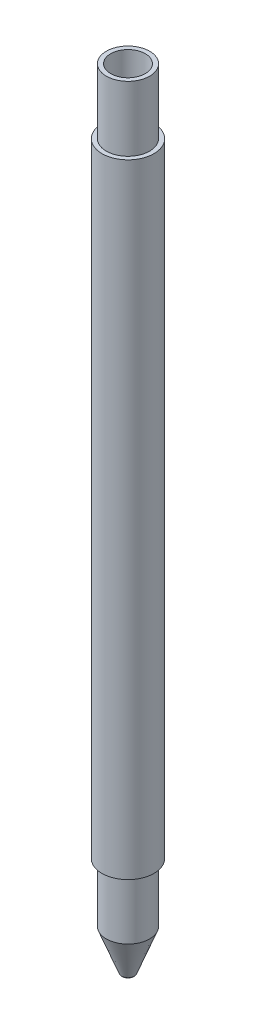
ISO-10303-21;
HEADER;
FILE_DESCRIPTION(('STEP AP214'),'2;1');
FILE_NAME('part.step','',(''),(''),'','','');
FILE_SCHEMA(('AUTOMOTIVE_DESIGN { 1 0 10303 214 1 1 1 1 }'));
ENDSEC;
DATA;
#1=APPLICATION_CONTEXT('core data for automotive mechanical design processes');
#2=APPLICATION_PROTOCOL_DEFINITION('international standard','automotive_design',2000,#1);
#3=PRODUCT_CONTEXT('',#1,'mechanical');
#4=PRODUCT('Part','Part','',(#3));
#5=PRODUCT_RELATED_PRODUCT_CATEGORY('part','',(#4));
#6=PRODUCT_DEFINITION_FORMATION('','',#4);
#7=PRODUCT_DEFINITION_CONTEXT('part definition',#1,'design');
#8=PRODUCT_DEFINITION('design','',#6,#7);
#9=PRODUCT_DEFINITION_SHAPE('','',#8);
#10=(LENGTH_UNIT() NAMED_UNIT(*) SI_UNIT(.MILLI.,.METRE.));
#11=(NAMED_UNIT(*) PLANE_ANGLE_UNIT() SI_UNIT($,.RADIAN.));
#12=(NAMED_UNIT(*) SI_UNIT($,.STERADIAN.) SOLID_ANGLE_UNIT());
#13=UNCERTAINTY_MEASURE_WITH_UNIT(LENGTH_MEASURE(1.E-05),#10,'distance_accuracy_value','');
#14=(GEOMETRIC_REPRESENTATION_CONTEXT(3) GLOBAL_UNCERTAINTY_ASSIGNED_CONTEXT((#13)) GLOBAL_UNIT_ASSIGNED_CONTEXT((#10,
#11,#12)) REPRESENTATION_CONTEXT('',''));
#15=CARTESIAN_POINT('',(0.,0.,0.));
#16=DIRECTION('',(0.,0.,1.));
#17=DIRECTION('',(1.,0.,0.));
#18=AXIS2_PLACEMENT_3D('',#15,#16,#17);
#19=CARTESIAN_POINT('',(0.,85.,0.));
#20=DIRECTION('',(0.,-1.,0.));
#21=DIRECTION('',(0.,0.,-1.));
#22=AXIS2_PLACEMENT_3D('',#19,#20,#21);
#23=CYLINDRICAL_SURFACE('',#22,6.);
#24=CARTESIAN_POINT('',(0.,-74.,0.));
#25=DIRECTION('',(0.,1.,0.));
#26=DIRECTION('',(0.,0.,1.));
#27=AXIS2_PLACEMENT_3D('',#24,#25,#26);
#28=CIRCLE('',#27,6.);
#29=CARTESIAN_POINT('',(0.,-74.,6.));
#30=VERTEX_POINT('',#29);
#31=EDGE_CURVE('E60',#30,#30,#28,.T.);
#32=ORIENTED_EDGE('',*,*,#31,.T.);
#33=EDGE_LOOP('',(#32));
#34=FACE_BOUND('',#33,.T.);
#35=CARTESIAN_POINT('',(0.,70.,0.));
#36=DIRECTION('',(0.,1.,0.));
#37=DIRECTION('',(0.,0.,1.));
#38=AXIS2_PLACEMENT_3D('',#35,#36,#37);
#39=CIRCLE('',#38,6.);
#40=CARTESIAN_POINT('',(0.,70.,6.));
#41=VERTEX_POINT('',#40);
#42=EDGE_CURVE('E36',#41,#41,#39,.T.);
#43=ORIENTED_EDGE('',*,*,#42,.F.);
#44=EDGE_LOOP('',(#43));
#45=FACE_BOUND('',#44,.T.);
#46=ADVANCED_FACE('F28',(#34,#45),#23,.T.);
#47=CARTESIAN_POINT('',(0.,-85.,0.));
#48=DIRECTION('',(0.,1.,0.));
#49=DIRECTION('',(0.,0.,-1.));
#50=AXIS2_PLACEMENT_3D('',#47,#48,#49);
#51=CONICAL_SURFACE('',#50,6.,0.36651914291881);
#52=CARTESIAN_POINT('',(0.,-87.6050890646938,0.));
#53=DIRECTION('',(0.,1.,0.));
#54=DIRECTION('',(0.,0.,1.));
#55=AXIS2_PLACEMENT_3D('',#52,#53,#54);
#56=CIRCLE('',#55,5.);
#57=CARTESIAN_POINT('',(0.,-87.6050890646938,-5.));
#58=VERTEX_POINT('',#57);
#59=EDGE_CURVE('E32',#58,#58,#56,.F.);
#60=CARTESIAN_POINT('',(0.,-96.7667795441443,0.));
#61=DIRECTION('',(0.,-1.,0.));
#62=DIRECTION('',(0.,0.,-1.));
#63=AXIS2_PLACEMENT_3D('',#60,#61,#62);
#64=CIRCLE('',#63,1.48315652481258);
#65=CARTESIAN_POINT('',(0.,-96.7667795441443,-1.48315652481258));
#66=VERTEX_POINT('',#65);
#67=EDGE_CURVE('E10',#66,#66,#64,.F.);
#68=CARTESIAN_POINT('',(0.,-87.6050890646938,-5.));
#69=CARTESIAN_POINT('',(0.,-87.7005233405214,-4.96336621380013));
#70=CARTESIAN_POINT('',(0.,-87.795957616349,-4.92673242760026));
#71=CARTESIAN_POINT('',(0.,-87.9868261680042,-4.85346485520052));
#72=CARTESIAN_POINT('',(0.,-88.0822604438319,-4.81683106900065));
#73=CARTESIAN_POINT('',(0.,-88.2731289954871,-4.74356349660091));
#74=CARTESIAN_POINT('',(0.,-88.3685632713147,-4.70692971040105));
#75=CARTESIAN_POINT('',(0.,-88.5594318229699,-4.63366213800131));
#76=CARTESIAN_POINT('',(0.,-88.6548660987975,-4.59702835180144));
#77=CARTESIAN_POINT('',(0.,-88.8457346504527,-4.5237607794017));
#78=CARTESIAN_POINT('',(0.,-88.9411689262803,-4.48712699320183));
#79=CARTESIAN_POINT('',(0.,-89.1320374779356,-4.4138594208021));
#80=CARTESIAN_POINT('',(0.,-89.2274717537632,-4.37722563460223));
#81=CARTESIAN_POINT('',(0.,-89.4183403054184,-4.30395806220249));
#82=CARTESIAN_POINT('',(0.,-89.513774581246,-4.26732427600262));
#83=CARTESIAN_POINT('',(0.,-89.7046431329012,-4.19405670360288));
#84=CARTESIAN_POINT('',(0.,-89.8000774087288,-4.15742291740301));
#85=CARTESIAN_POINT('',(0.,-89.990945960384,-4.08415534500327));
#86=CARTESIAN_POINT('',(0.,-90.0863802362116,-4.04752155880341));
#87=CARTESIAN_POINT('',(0.,-90.2772487878669,-3.97425398640367));
#88=CARTESIAN_POINT('',(0.,-90.3726830636945,-3.9376202002038));
#89=CARTESIAN_POINT('',(0.,-90.5635516153497,-3.86435262780406));
#90=CARTESIAN_POINT('',(0.,-90.6589858911773,-3.82771884160419));
#91=CARTESIAN_POINT('',(0.,-90.8498544428325,-3.75445126920445));
#92=CARTESIAN_POINT('',(0.,-90.9452887186601,-3.71781748300458));
#93=CARTESIAN_POINT('',(0.,-91.1361572703154,-3.64454991060485));
#94=CARTESIAN_POINT('',(0.,-91.231591546143,-3.60791612440498));
#95=CARTESIAN_POINT('',(0.,-91.4224600977982,-3.53464855200524));
#96=CARTESIAN_POINT('',(0.,-91.5178943736258,-3.49801476580537));
#97=CARTESIAN_POINT('',(0.,-91.708762925281,-3.42474719340563));
#98=CARTESIAN_POINT('',(0.,-91.8041972011086,-3.38811340720576));
#99=CARTESIAN_POINT('',(0.,-91.9950657527638,-3.31484583480603));
#100=CARTESIAN_POINT('',(0.,-92.0905000285914,-3.27821204860616));
#101=CARTESIAN_POINT('',(0.,-92.2813685802466,-3.20494447620642));
#102=CARTESIAN_POINT('',(0.,-92.3768028560743,-3.16831069000655));
#103=CARTESIAN_POINT('',(0.,-92.5676714077295,-3.09504311760681));
#104=CARTESIAN_POINT('',(0.,-92.6631056835571,-3.05840933140694));
#105=CARTESIAN_POINT('',(0.,-92.8539742352123,-2.98514175900721));
#106=CARTESIAN_POINT('',(0.,-92.9494085110399,-2.94850797280734));
#107=CARTESIAN_POINT('',(0.,-93.1402770626951,-2.8752404004076));
#108=CARTESIAN_POINT('',(0.,-93.2357113385227,-2.83860661420773));
#109=CARTESIAN_POINT('',(0.,-93.426579890178,-2.76533904180799));
#110=CARTESIAN_POINT('',(0.,-93.5220141660056,-2.72870525560812));
#111=CARTESIAN_POINT('',(0.,-93.7128827176608,-2.65543768320838));
#112=CARTESIAN_POINT('',(0.,-93.8083169934884,-2.61880389700852));
#113=CARTESIAN_POINT('',(0.,-93.9991855451436,-2.54553632460878));
#114=CARTESIAN_POINT('',(0.,-94.0946198209712,-2.50890253840891));
#115=CARTESIAN_POINT('',(0.,-94.2854883726264,-2.43563496600917));
#116=CARTESIAN_POINT('',(0.,-94.380922648454,-2.3990011798093));
#117=CARTESIAN_POINT('',(0.,-94.5717912001093,-2.32573360740956));
#118=CARTESIAN_POINT('',(0.,-94.6672254759369,-2.28909982120969));
#119=CARTESIAN_POINT('',(0.,-94.8580940275921,-2.21583224880996));
#120=CARTESIAN_POINT('',(0.,-94.9535283034197,-2.17919846261009));
#121=CARTESIAN_POINT('',(0.,-95.1443968550749,-2.10593089021035));
#122=CARTESIAN_POINT('',(0.,-95.2398311309025,-2.06929710401048));
#123=CARTESIAN_POINT('',(0.,-95.4306996825578,-1.99602953161074));
#124=CARTESIAN_POINT('',(0.,-95.5261339583854,-1.95939574541088));
#125=CARTESIAN_POINT('',(0.,-95.7170025100406,-1.88612817301114));
#126=CARTESIAN_POINT('',(0.,-95.8124367858682,-1.84949438681127));
#127=CARTESIAN_POINT('',(0.,-96.0033053375234,-1.77622681441153));
#128=CARTESIAN_POINT('',(0.,-96.098739613351,-1.73959302821166));
#129=CARTESIAN_POINT('',(0.,-96.2896081650062,-1.66632545581192));
#130=CARTESIAN_POINT('',(0.,-96.3850424408338,-1.62969166961205));
#131=CARTESIAN_POINT('',(0.,-96.5759109924891,-1.55642409721232));
#132=CARTESIAN_POINT('',(0.,-96.6713452683167,-1.51979031101245));
#133=CARTESIAN_POINT('',(0.,-96.7667795441443,-1.48315652481258));
#134=B_SPLINE_CURVE_WITH_KNOTS('',3,(#68,#69,#70,#71,#72,#73,#74,#75,#76,#77,#78,#79,#80,#81,
#82,#83,#84,#85,#86,#87,#88,#89,#90,#91,#92,#93,#94,#95,#96,#97,#98,#99,#100,#101,#102,#103,
#104,#105,#106,#107,#108,#109,#110,#111,#112,#113,#114,#115,#116,#117,#118,#119,#120,#121,#122,
#123,#124,#125,#126,#127,#128,#129,#130,#131,#132,#133),.UNSPECIFIED.,.F.,.F.,(4,2,2,2,2,2,2,2,
2,2,2,2,2,2,2,2,2,2,2,2,2,2,2,2,2,2,2,2,2,2,2,2,4),(0.,0.306671840322363,0.613343680644713,
0.920015520967077,1.22668736128943,1.53335920161179,1.84003104193414,2.1467028822565,
2.45337472257885,2.76004656290122,3.06671840322357,3.37339024354593,3.68006208386828,
3.98673392419064,4.29340576451299,4.60007760483536,4.90674944515771,5.21342128548006,
5.52009312580242,5.82676496612477,6.13343680644714,6.44010864676949,6.74678048709185,
7.0534523274142,7.36012416773656,7.66679600805891,7.97346784838128,8.28013968870363,
8.58681152902599,8.89348336934834,9.20015520967069,9.50682704999305,9.81349889031542),.UNSPECIFIED.);
#135=EDGE_CURVE('BSEAM76',#58,#66,#134,.T.);
#136=ORIENTED_EDGE('',*,*,#59,.T.);
#137=ORIENTED_EDGE('',*,*,#67,.T.);
#138=ORIENTED_EDGE('',*,*,#135,.T.);
#139=ORIENTED_EDGE('',*,*,#135,.F.);
#140=EDGE_LOOP('',(#136,#138,#137,#139));
#141=FACE_BOUND('',#140,.T.);
#142=ADVANCED_FACE('F76',(#141),#51,.T.);
#143=CARTESIAN_POINT('',(0.,70.,0.));
#144=DIRECTION('',(0.,1.,0.));
#145=DIRECTION('',(0.,0.,1.));
#146=AXIS2_PLACEMENT_3D('',#143,#144,#145);
#147=PLANE('',#146);
#148=CARTESIAN_POINT('',(0.,70.,0.));
#149=DIRECTION('',(0.,1.,0.));
#150=DIRECTION('',(0.,0.,1.));
#151=AXIS2_PLACEMENT_3D('',#148,#149,#150);
#152=CIRCLE('',#151,5.);
#153=CARTESIAN_POINT('',(0.,70.,5.));
#154=VERTEX_POINT('',#153);
#155=EDGE_CURVE('E40',#154,#154,#152,.T.);
#156=ORIENTED_EDGE('',*,*,#155,.F.);
#157=EDGE_LOOP('',(#156));
#158=FACE_BOUND('',#157,.T.);
#159=ORIENTED_EDGE('',*,*,#42,.T.);
#160=EDGE_LOOP('',(#159));
#161=FACE_BOUND('',#160,.T.);
#162=ADVANCED_FACE('F78',(#158,#161),#147,.T.);
#163=CARTESIAN_POINT('',(0.,70.,0.));
#164=DIRECTION('',(0.,1.,0.));
#165=DIRECTION('',(0.,0.,1.));
#166=AXIS2_PLACEMENT_3D('',#163,#164,#165);
#167=CYLINDRICAL_SURFACE('',#166,5.);
#168=ORIENTED_EDGE('',*,*,#155,.T.);
#169=EDGE_LOOP('',(#168));
#170=FACE_BOUND('',#169,.T.);
#171=CARTESIAN_POINT('',(0.,85.,0.));
#172=DIRECTION('',(0.,1.,0.));
#173=DIRECTION('',(0.,0.,1.));
#174=AXIS2_PLACEMENT_3D('',#171,#172,#173);
#175=CIRCLE('',#174,5.);
#176=CARTESIAN_POINT('',(0.,85.,5.));
#177=VERTEX_POINT('',#176);
#178=EDGE_CURVE('E43',#177,#177,#175,.T.);
#179=ORIENTED_EDGE('',*,*,#178,.F.);
#180=EDGE_LOOP('',(#179));
#181=FACE_BOUND('',#180,.T.);
#182=ADVANCED_FACE('F84',(#170,#181),#167,.T.);
#183=CARTESIAN_POINT('',(0.,85.,0.));
#184=DIRECTION('',(0.,1.,0.));
#185=DIRECTION('',(0.,0.,1.));
#186=AXIS2_PLACEMENT_3D('',#183,#184,#185);
#187=PLANE('',#186);
#188=CARTESIAN_POINT('',(0.,85.,0.));
#189=DIRECTION('',(0.,1.,0.));
#190=DIRECTION('',(0.,0.,1.));
#191=AXIS2_PLACEMENT_3D('',#188,#189,#190);
#192=CIRCLE('',#191,4.);
#193=CARTESIAN_POINT('',(0.,85.,4.));
#194=VERTEX_POINT('',#193);
#195=EDGE_CURVE('E46',#194,#194,#192,.T.);
#196=ORIENTED_EDGE('',*,*,#195,.F.);
#197=EDGE_LOOP('',(#196));
#198=FACE_BOUND('',#197,.T.);
#199=ORIENTED_EDGE('',*,*,#178,.T.);
#200=EDGE_LOOP('',(#199));
#201=FACE_BOUND('',#200,.T.);
#202=ADVANCED_FACE('F90',(#198,#201),#187,.T.);
#203=CARTESIAN_POINT('',(0.,-85.,0.));
#204=DIRECTION('',(0.,1.,0.));
#205=DIRECTION('',(0.,0.,1.));
#206=AXIS2_PLACEMENT_3D('',#203,#204,#205);
#207=CYLINDRICAL_SURFACE('',#206,4.);
#208=CARTESIAN_POINT('',(0.,-85.,0.));
#209=DIRECTION('',(0.,1.,0.));
#210=DIRECTION('',(0.,0.,1.));
#211=AXIS2_PLACEMENT_3D('',#208,#209,#210);
#212=CIRCLE('',#211,4.);
#213=CARTESIAN_POINT('',(0.,-85.,4.));
#214=VERTEX_POINT('',#213);
#215=EDGE_CURVE('E51',#214,#214,#212,.T.);
#216=ORIENTED_EDGE('',*,*,#215,.F.);
#217=EDGE_LOOP('',(#216));
#218=FACE_BOUND('',#217,.T.);
#219=ORIENTED_EDGE('',*,*,#195,.T.);
#220=EDGE_LOOP('',(#219));
#221=FACE_BOUND('',#220,.T.);
#222=ADVANCED_FACE('F92',(#218,#221),#207,.F.);
#223=CARTESIAN_POINT('',(0.,-85.,0.));
#224=DIRECTION('',(0.,1.,0.));
#225=DIRECTION('',(0.,0.,1.));
#226=AXIS2_PLACEMENT_3D('',#223,#224,#225);
#227=CONICAL_SURFACE('',#226,4.,0.26179938779915);
#228=CARTESIAN_POINT('',(0.,-95.08,0.));
#229=DIRECTION('',(0.,1.,0.));
#230=DIRECTION('',(0.,0.,1.));
#231=AXIS2_PLACEMENT_3D('',#228,#229,#230);
#232=CIRCLE('',#231,1.29907214029427);
#233=CARTESIAN_POINT('',(0.,-95.08,1.29907214029427));
#234=VERTEX_POINT('',#233);
#235=EDGE_CURVE('E55',#234,#234,#232,.T.);
#236=CARTESIAN_POINT('',(0.,-95.08,1.29907214029427));
#237=CARTESIAN_POINT('',(0.,-94.975,1.32720680549954));
#238=CARTESIAN_POINT('',(0.,-94.87,1.35534147070481));
#239=CARTESIAN_POINT('',(0.,-94.66,1.41161080111534));
#240=CARTESIAN_POINT('',(0.,-94.555,1.43974546632061));
#241=CARTESIAN_POINT('',(0.,-94.345,1.49601479673115));
#242=CARTESIAN_POINT('',(0.,-94.24,1.52414946193642));
#243=CARTESIAN_POINT('',(0.,-94.03,1.58041879234695));
#244=CARTESIAN_POINT('',(0.,-93.925,1.60855345755222));
#245=CARTESIAN_POINT('',(0.,-93.715,1.66482278796276));
#246=CARTESIAN_POINT('',(0.,-93.61,1.69295745316802));
#247=CARTESIAN_POINT('',(0.,-93.4,1.74922678357856));
#248=CARTESIAN_POINT('',(0.,-93.295,1.77736144878383));
#249=CARTESIAN_POINT('',(0.,-93.085,1.83363077919436));
#250=CARTESIAN_POINT('',(0.,-92.98,1.86176544439963));
#251=CARTESIAN_POINT('',(0.,-92.77,1.91803477481017));
#252=CARTESIAN_POINT('',(0.,-92.665,1.94616944001544));
#253=CARTESIAN_POINT('',(0.,-92.455,2.00243877042597));
#254=CARTESIAN_POINT('',(0.,-92.35,2.03057343563124));
#255=CARTESIAN_POINT('',(0.,-92.14,2.08684276604178));
#256=CARTESIAN_POINT('',(0.,-92.035,2.11497743124704));
#257=CARTESIAN_POINT('',(0.,-91.825,2.17124676165758));
#258=CARTESIAN_POINT('',(0.,-91.72,2.19938142686285));
#259=CARTESIAN_POINT('',(0.,-91.51,2.25565075727338));
#260=CARTESIAN_POINT('',(0.,-91.405,2.28378542247865));
#261=CARTESIAN_POINT('',(0.,-91.195,2.34005475288919));
#262=CARTESIAN_POINT('',(0.,-91.09,2.36818941809446));
#263=CARTESIAN_POINT('',(0.,-90.88,2.42445874850499));
#264=CARTESIAN_POINT('',(0.,-90.775,2.45259341371026));
#265=CARTESIAN_POINT('',(0.,-90.565,2.5088627441208));
#266=CARTESIAN_POINT('',(0.,-90.46,2.53699740932606));
#267=CARTESIAN_POINT('',(0.,-90.25,2.5932667397366));
#268=CARTESIAN_POINT('',(0.,-90.145,2.62140140494187));
#269=CARTESIAN_POINT('',(0.,-89.935,2.6776707353524));
#270=CARTESIAN_POINT('',(0.,-89.83,2.70580540055767));
#271=CARTESIAN_POINT('',(0.,-89.62,2.76207473096821));
#272=CARTESIAN_POINT('',(0.,-89.515,2.79020939617348));
#273=CARTESIAN_POINT('',(0.,-89.305,2.84647872658401));
#274=CARTESIAN_POINT('',(0.,-89.2,2.87461339178928));
#275=CARTESIAN_POINT('',(0.,-88.99,2.93088272219982));
#276=CARTESIAN_POINT('',(0.,-88.885,2.95901738740508));
#277=CARTESIAN_POINT('',(0.,-88.675,3.01528671781562));
#278=CARTESIAN_POINT('',(0.,-88.57,3.04342138302089));
#279=CARTESIAN_POINT('',(0.,-88.36,3.09969071343142));
#280=CARTESIAN_POINT('',(0.,-88.255,3.12782537863669));
#281=CARTESIAN_POINT('',(0.,-88.045,3.18409470904723));
#282=CARTESIAN_POINT('',(0.,-87.94,3.21222937425249));
#283=CARTESIAN_POINT('',(0.,-87.73,3.26849870466303));
#284=CARTESIAN_POINT('',(0.,-87.625,3.2966333698683));
#285=CARTESIAN_POINT('',(0.,-87.415,3.35290270027884));
#286=CARTESIAN_POINT('',(0.,-87.31,3.3810373654841));
#287=CARTESIAN_POINT('',(0.,-87.1,3.43730669589464));
#288=CARTESIAN_POINT('',(0.,-86.995,3.46544136109991));
#289=CARTESIAN_POINT('',(0.,-86.785,3.52171069151044));
#290=CARTESIAN_POINT('',(0.,-86.68,3.54984535671571));
#291=CARTESIAN_POINT('',(0.,-86.47,3.60611468712625));
#292=CARTESIAN_POINT('',(0.,-86.365,3.63424935233151));
#293=CARTESIAN_POINT('',(0.,-86.155,3.69051868274205));
#294=CARTESIAN_POINT('',(0.,-86.05,3.71865334794732));
#295=CARTESIAN_POINT('',(0.,-85.84,3.77492267835785));
#296=CARTESIAN_POINT('',(0.,-85.735,3.80305734356312));
#297=CARTESIAN_POINT('',(0.,-85.525,3.85932667397366));
#298=CARTESIAN_POINT('',(0.,-85.42,3.88746133917893));
#299=CARTESIAN_POINT('',(0.,-85.21,3.94373066958946));
#300=CARTESIAN_POINT('',(0.,-85.105,3.97186533479473));
#301=CARTESIAN_POINT('',(0.,-85.,4.));
#302=B_SPLINE_CURVE_WITH_KNOTS('',3,(#236,#237,#238,#239,#240,#241,#242,#243,#244,#245,#246,
#247,#248,#249,#250,#251,#252,#253,#254,#255,#256,#257,#258,#259,#260,#261,#262,#263,#264,#265,
#266,#267,#268,#269,#270,#271,#272,#273,#274,#275,#276,#277,#278,#279,#280,#281,#282,#283,#284,
#285,#286,#287,#288,#289,#290,#291,#292,#293,#294,#295,#296,#297,#298,#299,#300,#301),
.UNSPECIFIED.,.F.,.F.,(4,2,2,2,2,2,2,2,2,2,2,2,2,2,2,2,2,2,2,2,2,2,2,2,2,2,2,2,2,2,2,2,4),(0.,
0.326111996829186,0.652223993658358,0.97833599048753,1.30444798731672,1.63055998414589,
1.95667198097506,2.28278397780425,2.60889597463342,2.93500797146259,3.26111996829178,
3.58723196512095,3.91334396195012,4.23945595877931,4.56556795560848,4.89167995243765,
5.21779194926684,5.54390394609601,5.87001594292518,6.19612793975435,6.52223993658354,
6.84835193341271,7.17446393024188,7.50057592707107,7.82668792390024,8.15279992072941,
8.4789119175586,8.80502391438777,9.13113591121694,9.45724790804611,9.7833599048753,
10.1094719017045,10.4355838985336),.UNSPECIFIED.);
#303=EDGE_CURVE('BSEAM98',#234,#214,#302,.T.);
#304=ORIENTED_EDGE('',*,*,#235,.F.);
#305=ORIENTED_EDGE('',*,*,#215,.T.);
#306=ORIENTED_EDGE('',*,*,#303,.T.);
#307=ORIENTED_EDGE('',*,*,#303,.F.);
#308=EDGE_LOOP('',(#304,#306,#305,#307));
#309=FACE_BOUND('',#308,.T.);
#310=ADVANCED_FACE('F98',(#309),#227,.F.);
#311=CARTESIAN_POINT('',(0.,-97.,0.));
#312=DIRECTION('',(0.,1.,0.));
#313=DIRECTION('',(0.,0.,1.));
#314=AXIS2_PLACEMENT_3D('',#311,#312,#313);
#315=CYLINDRICAL_SURFACE('',#314,1.29907214029427);
#316=CARTESIAN_POINT('',(0.,-97.,0.));
#317=DIRECTION('',(0.,1.,0.));
#318=DIRECTION('',(0.,0.,1.));
#319=AXIS2_PLACEMENT_3D('',#316,#317,#318);
#320=CIRCLE('',#319,1.29907214029427);
#321=CARTESIAN_POINT('',(0.,-97.,1.29907214029427));
#322=VERTEX_POINT('',#321);
#323=EDGE_CURVE('E54',#322,#322,#320,.T.);
#324=ORIENTED_EDGE('',*,*,#323,.F.);
#325=EDGE_LOOP('',(#324));
#326=FACE_BOUND('',#325,.T.);
#327=ORIENTED_EDGE('',*,*,#235,.T.);
#328=EDGE_LOOP('',(#327));
#329=FACE_BOUND('',#328,.T.);
#330=ADVANCED_FACE('F112',(#326,#329),#315,.F.);
#331=CARTESIAN_POINT('',(0.,-96.5875955693716,0.));
#332=DIRECTION('',(0.,-1.,0.));
#333=DIRECTION('',(0.,0.,-1.));
#334=AXIS2_PLACEMENT_3D('',#331,#332,#333);
#335=TOROIDAL_SURFACE('',#334,1.01636631156398,0.5);
#336=ORIENTED_EDGE('',*,*,#67,.F.);
#337=EDGE_LOOP('',(#336));
#338=FACE_BOUND('',#337,.T.);
#339=ORIENTED_EDGE('',*,*,#323,.T.);
#340=EDGE_LOOP('',(#339));
#341=FACE_BOUND('',#340,.T.);
#342=ADVANCED_FACE('F30',(#338,#341),#335,.T.);
#343=CARTESIAN_POINT('',(0.,-74.,0.));
#344=DIRECTION('',(0.,-1.,0.));
#345=DIRECTION('',(0.,0.,-1.));
#346=AXIS2_PLACEMENT_3D('',#343,#344,#345);
#347=CYLINDRICAL_SURFACE('',#346,5.);
#348=CARTESIAN_POINT('',(0.,-74.,0.));
#349=DIRECTION('',(0.,1.,0.));
#350=DIRECTION('',(0.,0.,1.));
#351=AXIS2_PLACEMENT_3D('',#348,#349,#350);
#352=CIRCLE('',#351,5.);
#353=CARTESIAN_POINT('',(0.,-74.,-5.));
#354=VERTEX_POINT('',#353);
#355=EDGE_CURVE('E63',#354,#354,#352,.T.);
#356=CARTESIAN_POINT('',(0.,-74.,-5.));
#357=CARTESIAN_POINT('',(0.,-74.1417196777572,-5.));
#358=CARTESIAN_POINT('',(0.,-74.2834393555145,-5.));
#359=CARTESIAN_POINT('',(0.,-74.5668787110289,-5.));
#360=CARTESIAN_POINT('',(0.,-74.7085983887861,-5.));
#361=CARTESIAN_POINT('',(0.,-74.9920377443006,-5.));
#362=CARTESIAN_POINT('',(0.,-75.1337574220578,-5.));
#363=CARTESIAN_POINT('',(0.,-75.4171967775723,-5.));
#364=CARTESIAN_POINT('',(0.,-75.5589164553295,-5.));
#365=CARTESIAN_POINT('',(0.,-75.8423558108439,-5.));
#366=CARTESIAN_POINT('',(0.,-75.9840754886012,-5.));
#367=CARTESIAN_POINT('',(0.,-76.2675148441156,-5.));
#368=CARTESIAN_POINT('',(0.,-76.4092345218729,-5.));
#369=CARTESIAN_POINT('',(0.,-76.6926738773873,-5.));
#370=CARTESIAN_POINT('',(0.,-76.8343935551446,-5.));
#371=CARTESIAN_POINT('',(0.,-77.117832910659,-5.));
#372=CARTESIAN_POINT('',(0.,-77.2595525884162,-5.));
#373=CARTESIAN_POINT('',(0.,-77.5429919439307,-5.));
#374=CARTESIAN_POINT('',(0.,-77.6847116216879,-5.));
#375=CARTESIAN_POINT('',(0.,-77.9681509772024,-5.));
#376=CARTESIAN_POINT('',(0.,-78.1098706549596,-5.));
#377=CARTESIAN_POINT('',(0.,-78.393310010474,-5.));
#378=CARTESIAN_POINT('',(0.,-78.5350296882313,-5.));
#379=CARTESIAN_POINT('',(0.,-78.8184690437457,-5.));
#380=CARTESIAN_POINT('',(0.,-78.960188721503,-5.));
#381=CARTESIAN_POINT('',(0.,-79.2436280770174,-5.));
#382=CARTESIAN_POINT('',(0.,-79.3853477547746,-5.));
#383=CARTESIAN_POINT('',(0.,-79.6687871102891,-5.));
#384=CARTESIAN_POINT('',(0.,-79.8105067880463,-5.));
#385=CARTESIAN_POINT('',(0.,-80.0939461435608,-5.));
#386=CARTESIAN_POINT('',(0.,-80.235665821318,-5.));
#387=CARTESIAN_POINT('',(0.,-80.5191051768324,-5.));
#388=CARTESIAN_POINT('',(0.,-80.6608248545897,-5.));
#389=CARTESIAN_POINT('',(0.,-80.9442642101041,-5.));
#390=CARTESIAN_POINT('',(0.,-81.0859838878614,-5.));
#391=CARTESIAN_POINT('',(0.,-81.3694232433758,-5.));
#392=CARTESIAN_POINT('',(0.,-81.511142921133,-5.));
#393=CARTESIAN_POINT('',(0.,-81.7945822766475,-5.));
#394=CARTESIAN_POINT('',(0.,-81.9363019544047,-5.));
#395=CARTESIAN_POINT('',(0.,-82.2197413099192,-5.));
#396=CARTESIAN_POINT('',(0.,-82.3614609876764,-5.));
#397=CARTESIAN_POINT('',(0.,-82.6449003431909,-5.));
#398=CARTESIAN_POINT('',(0.,-82.7866200209481,-5.));
#399=CARTESIAN_POINT('',(0.,-83.0700593764625,-5.));
#400=CARTESIAN_POINT('',(0.,-83.2117790542198,-5.));
#401=CARTESIAN_POINT('',(0.,-83.4952184097342,-5.));
#402=CARTESIAN_POINT('',(0.,-83.6369380874915,-5.));
#403=CARTESIAN_POINT('',(0.,-83.9203774430059,-5.));
#404=CARTESIAN_POINT('',(0.,-84.0620971207631,-5.));
#405=CARTESIAN_POINT('',(0.,-84.3455364762776,-5.));
#406=CARTESIAN_POINT('',(0.,-84.4872561540348,-5.));
#407=CARTESIAN_POINT('',(0.,-84.7706955095493,-5.));
#408=CARTESIAN_POINT('',(0.,-84.9124151873065,-5.));
#409=CARTESIAN_POINT('',(0.,-85.1958545428209,-5.));
#410=CARTESIAN_POINT('',(0.,-85.3375742205782,-5.));
#411=CARTESIAN_POINT('',(0.,-85.6210135760926,-5.));
#412=CARTESIAN_POINT('',(0.,-85.7627332538499,-5.));
#413=CARTESIAN_POINT('',(0.,-86.0461726093643,-5.));
#414=CARTESIAN_POINT('',(0.,-86.1878922871215,-5.));
#415=CARTESIAN_POINT('',(0.,-86.471331642636,-5.));
#416=CARTESIAN_POINT('',(0.,-86.6130513203932,-5.));
#417=CARTESIAN_POINT('',(0.,-86.8964906759077,-5.));
#418=CARTESIAN_POINT('',(0.,-87.0382103536649,-5.));
#419=CARTESIAN_POINT('',(0.,-87.3216497091794,-5.));
#420=CARTESIAN_POINT('',(0.,-87.4633693869366,-5.));
#421=CARTESIAN_POINT('',(0.,-87.6050890646938,-5.));
#422=B_SPLINE_CURVE_WITH_KNOTS('',3,(#356,#357,#358,#359,#360,#361,#362,#363,#364,#365,#366,
#367,#368,#369,#370,#371,#372,#373,#374,#375,#376,#377,#378,#379,#380,#381,#382,#383,#384,#385,
#386,#387,#388,#389,#390,#391,#392,#393,#394,#395,#396,#397,#398,#399,#400,#401,#402,#403,#404,
#405,#406,#407,#408,#409,#410,#411,#412,#413,#414,#415,#416,#417,#418,#419,#420,#421),
.UNSPECIFIED.,.F.,.F.,(4,2,2,2,2,2,2,2,2,2,2,2,2,2,2,2,2,2,2,2,2,2,2,2,2,2,2,2,2,2,2,2,4),(0.,
0.425159033271671,0.850318066543357,1.27547709981504,1.70063613308671,2.1257951663584,
2.55095419963008,2.97611323290177,3.40127226617344,3.82643129944513,4.25159033271681,
4.67674936598848,5.10190839926017,5.52706743253185,5.95222646580354,6.37738549907521,
6.8025445323469,7.22770356561858,7.65286259889025,8.07802163216194,8.50318066543362,
8.92833969870531,9.35349873197698,9.77865776524867,10.2038167985204,10.628975831792,
11.0541348650637,11.4792938983354,11.9044529316071,12.3296119648788,12.7547709981504,
13.1799300314221,13.6050890646938),.UNSPECIFIED.);
#423=EDGE_CURVE('BSEAM69',#354,#58,#422,.T.);
#424=ORIENTED_EDGE('',*,*,#355,.F.);
#425=ORIENTED_EDGE('',*,*,#59,.F.);
#426=ORIENTED_EDGE('',*,*,#423,.T.);
#427=ORIENTED_EDGE('',*,*,#423,.F.);
#428=EDGE_LOOP('',(#424,#426,#425,#427));
#429=FACE_BOUND('',#428,.T.);
#430=ADVANCED_FACE('F69',(#429),#347,.T.);
#431=CARTESIAN_POINT('',(0.,-74.,0.));
#432=DIRECTION('',(0.,1.,0.));
#433=DIRECTION('',(0.,0.,1.));
#434=AXIS2_PLACEMENT_3D('',#431,#432,#433);
#435=PLANE('',#434);
#436=ORIENTED_EDGE('',*,*,#31,.F.);
#437=EDGE_LOOP('',(#436));
#438=FACE_BOUND('',#437,.T.);
#439=ORIENTED_EDGE('',*,*,#355,.T.);
#440=EDGE_LOOP('',(#439));
#441=FACE_BOUND('',#440,.T.);
#442=ADVANCED_FACE('F67',(#438,#441),#435,.F.);
#443=CLOSED_SHELL('',(#46,#142,#162,#182,#202,#222,#310,#330,#342,#430,#442));
#444=MANIFOLD_SOLID_BREP('B2',#443);
#445=ADVANCED_BREP_SHAPE_REPRESENTATION('',(#18,#444),#14);
#446=SHAPE_DEFINITION_REPRESENTATION(#9,#445);
ENDSEC;
END-ISO-10303-21;
